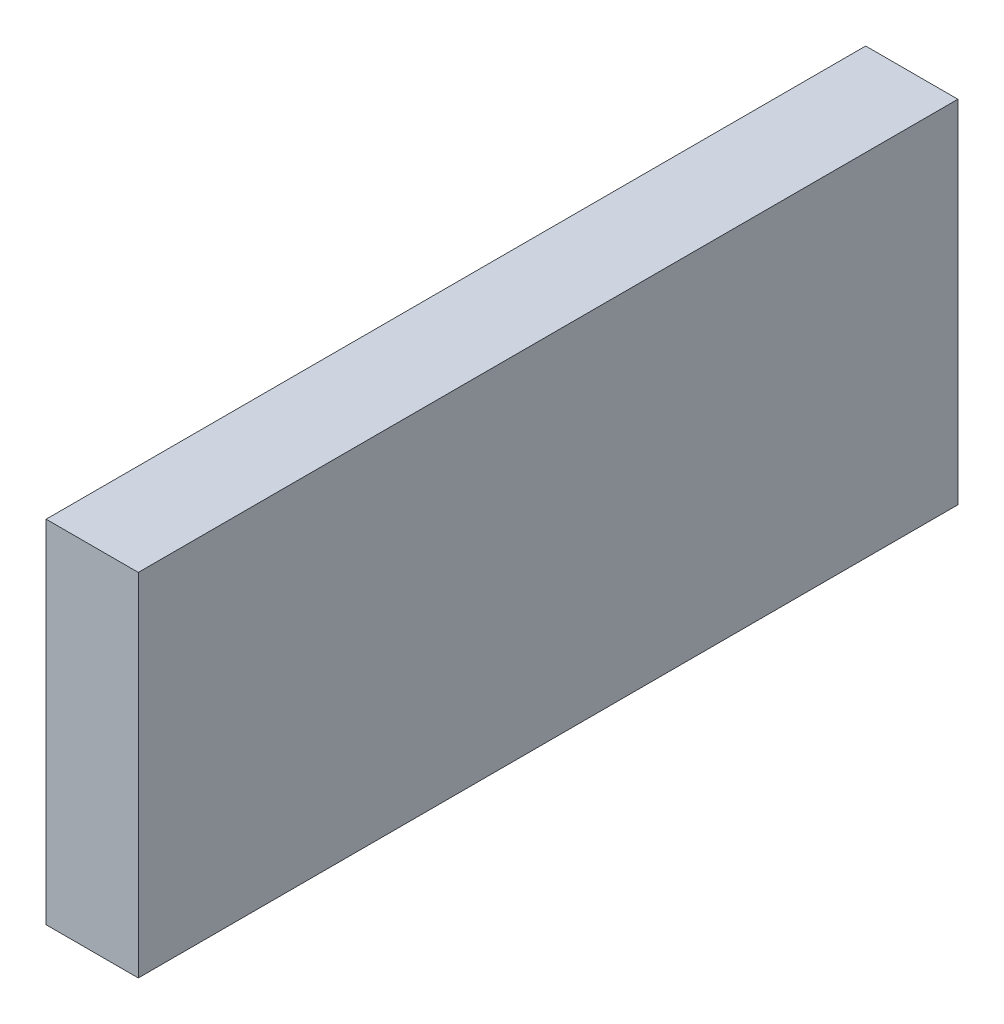
ISO-10303-21;
HEADER;
FILE_DESCRIPTION(('STEP AP214'),'2;1');
FILE_NAME('part.step','',(''),(''),'','','');
FILE_SCHEMA(('AUTOMOTIVE_DESIGN { 1 0 10303 214 1 1 1 1 }'));
ENDSEC;
DATA;
#1=APPLICATION_CONTEXT('core data for automotive mechanical design processes');
#2=APPLICATION_PROTOCOL_DEFINITION('international standard','automotive_design',2000,#1);
#3=PRODUCT_CONTEXT('',#1,'mechanical');
#4=PRODUCT('Part','Part','',(#3));
#5=PRODUCT_RELATED_PRODUCT_CATEGORY('part','',(#4));
#6=PRODUCT_DEFINITION_FORMATION('','',#4);
#7=PRODUCT_DEFINITION_CONTEXT('part definition',#1,'design');
#8=PRODUCT_DEFINITION('design','',#6,#7);
#9=PRODUCT_DEFINITION_SHAPE('','',#8);
#10=(LENGTH_UNIT() NAMED_UNIT(*) SI_UNIT(.MILLI.,.METRE.));
#11=(NAMED_UNIT(*) PLANE_ANGLE_UNIT() SI_UNIT($,.RADIAN.));
#12=(NAMED_UNIT(*) SI_UNIT($,.STERADIAN.) SOLID_ANGLE_UNIT());
#13=UNCERTAINTY_MEASURE_WITH_UNIT(LENGTH_MEASURE(1.E-05),#10,'distance_accuracy_value','');
#14=(GEOMETRIC_REPRESENTATION_CONTEXT(3) GLOBAL_UNCERTAINTY_ASSIGNED_CONTEXT((#13)) GLOBAL_UNIT_ASSIGNED_CONTEXT((#10,
#11,#12)) REPRESENTATION_CONTEXT('',''));
#15=CARTESIAN_POINT('',(0.,0.,0.));
#16=DIRECTION('',(0.,0.,1.));
#17=DIRECTION('',(1.,0.,0.));
#18=AXIS2_PLACEMENT_3D('',#15,#16,#17);
#19=CARTESIAN_POINT('',(10.,19.05,44.45));
#20=DIRECTION('',(0.,0.,-1.));
#21=DIRECTION('',(-1.,0.,0.));
#22=AXIS2_PLACEMENT_3D('',#19,#20,#21);
#23=PLANE('',#22);
#24=DIRECTION('',(0.,-1.,0.));
#25=VECTOR('',#24,1.);
#26=CARTESIAN_POINT('',(0.,19.05,44.45));
#27=LINE('',#26,#25);
#28=CARTESIAN_POINT('',(0.,19.05,44.45));
#29=VERTEX_POINT('',#28);
#30=CARTESIAN_POINT('',(0.,-19.05,44.45));
#31=VERTEX_POINT('',#30);
#32=EDGE_CURVE('E100',#29,#31,#27,.T.);
#33=ORIENTED_EDGE('',*,*,#32,.T.);
#34=DIRECTION('',(-1.,0.,0.));
#35=VECTOR('',#34,1.);
#36=CARTESIAN_POINT('',(10.,-19.05,44.45));
#37=LINE('',#36,#35);
#38=CARTESIAN_POINT('',(10.,-19.05,44.45));
#39=VERTEX_POINT('',#38);
#40=EDGE_CURVE('E11',#39,#31,#37,.T.);
#41=ORIENTED_EDGE('',*,*,#40,.F.);
#42=DIRECTION('',(0.,-1.,0.));
#43=VECTOR('',#42,1.);
#44=CARTESIAN_POINT('',(10.,19.05,44.45));
#45=LINE('',#44,#43);
#46=CARTESIAN_POINT('',(10.,19.05,44.45));
#47=VERTEX_POINT('',#46);
#48=EDGE_CURVE('E88',#47,#39,#45,.T.);
#49=ORIENTED_EDGE('',*,*,#48,.F.);
#50=DIRECTION('',(-1.,0.,0.));
#51=VECTOR('',#50,1.);
#52=CARTESIAN_POINT('',(10.,19.05,44.45));
#53=LINE('',#52,#51);
#54=EDGE_CURVE('E96',#47,#29,#53,.T.);
#55=ORIENTED_EDGE('',*,*,#54,.T.);
#56=EDGE_LOOP('',(#33,#41,#49,#55));
#57=FACE_BOUND('',#56,.T.);
#58=ADVANCED_FACE('F37',(#57),#23,.F.);
#59=CARTESIAN_POINT('',(10.,-19.05,44.45));
#60=DIRECTION('',(0.,1.,0.));
#61=DIRECTION('',(0.,0.,1.));
#62=AXIS2_PLACEMENT_3D('',#59,#60,#61);
#63=PLANE('',#62);
#64=DIRECTION('',(0.,0.,-1.));
#65=VECTOR('',#64,1.);
#66=CARTESIAN_POINT('',(0.,-19.05,44.45));
#67=LINE('',#66,#65);
#68=CARTESIAN_POINT('',(0.,-19.05,-44.45));
#69=VERTEX_POINT('',#68);
#70=EDGE_CURVE('E92',#31,#69,#67,.T.);
#71=ORIENTED_EDGE('',*,*,#70,.T.);
#72=DIRECTION('',(-1.,0.,0.));
#73=VECTOR('',#72,1.);
#74=CARTESIAN_POINT('',(10.,-19.05,-44.45));
#75=LINE('',#74,#73);
#76=CARTESIAN_POINT('',(10.,-19.05,-44.45));
#77=VERTEX_POINT('',#76);
#78=EDGE_CURVE('E45',#77,#69,#75,.T.);
#79=ORIENTED_EDGE('',*,*,#78,.F.);
#80=DIRECTION('',(0.,0.,-1.));
#81=VECTOR('',#80,1.);
#82=CARTESIAN_POINT('',(10.,-19.05,44.45));
#83=LINE('',#82,#81);
#84=EDGE_CURVE('E83',#39,#77,#83,.T.);
#85=ORIENTED_EDGE('',*,*,#84,.F.);
#86=ORIENTED_EDGE('',*,*,#40,.T.);
#87=EDGE_LOOP('',(#71,#79,#85,#86));
#88=FACE_BOUND('',#87,.T.);
#89=ADVANCED_FACE('F91',(#88),#63,.F.);
#90=CARTESIAN_POINT('',(10.,19.05,-44.45));
#91=DIRECTION('',(0.,0.,1.));
#92=DIRECTION('',(0.,-1.,0.));
#93=AXIS2_PLACEMENT_3D('',#90,#91,#92);
#94=PLANE('',#93);
#95=DIRECTION('',(0.,1.,0.));
#96=VECTOR('',#95,1.);
#97=CARTESIAN_POINT('',(0.,19.05,-44.45));
#98=LINE('',#97,#96);
#99=CARTESIAN_POINT('',(0.,19.05,-44.45));
#100=VERTEX_POINT('',#99);
#101=EDGE_CURVE('E70',#69,#100,#98,.T.);
#102=ORIENTED_EDGE('',*,*,#101,.T.);
#103=DIRECTION('',(-1.,0.,0.));
#104=VECTOR('',#103,1.);
#105=CARTESIAN_POINT('',(10.,19.05,-44.45));
#106=LINE('',#105,#104);
#107=CARTESIAN_POINT('',(10.,19.05,-44.45));
#108=VERTEX_POINT('',#107);
#109=EDGE_CURVE('E93',#108,#100,#106,.T.);
#110=ORIENTED_EDGE('',*,*,#109,.F.);
#111=DIRECTION('',(0.,1.,0.));
#112=VECTOR('',#111,1.);
#113=CARTESIAN_POINT('',(10.,19.05,-44.45));
#114=LINE('',#113,#112);
#115=EDGE_CURVE('E86',#77,#108,#114,.T.);
#116=ORIENTED_EDGE('',*,*,#115,.F.);
#117=ORIENTED_EDGE('',*,*,#78,.T.);
#118=EDGE_LOOP('',(#102,#110,#116,#117));
#119=FACE_BOUND('',#118,.T.);
#120=ADVANCED_FACE('F94',(#119),#94,.F.);
#121=CARTESIAN_POINT('',(10.,19.05,44.45));
#122=DIRECTION('',(0.,-1.,0.));
#123=DIRECTION('',(0.,0.,-1.));
#124=AXIS2_PLACEMENT_3D('',#121,#122,#123);
#125=PLANE('',#124);
#126=DIRECTION('',(0.,0.,1.));
#127=VECTOR('',#126,1.);
#128=CARTESIAN_POINT('',(0.,19.05,44.45));
#129=LINE('',#128,#127);
#130=EDGE_CURVE('E76',#100,#29,#129,.T.);
#131=ORIENTED_EDGE('',*,*,#130,.T.);
#132=ORIENTED_EDGE('',*,*,#54,.F.);
#133=DIRECTION('',(0.,0.,1.));
#134=VECTOR('',#133,1.);
#135=CARTESIAN_POINT('',(10.,19.05,44.45));
#136=LINE('',#135,#134);
#137=EDGE_CURVE('E53',#108,#47,#136,.T.);
#138=ORIENTED_EDGE('',*,*,#137,.F.);
#139=ORIENTED_EDGE('',*,*,#109,.T.);
#140=EDGE_LOOP('',(#131,#132,#138,#139));
#141=FACE_BOUND('',#140,.T.);
#142=ADVANCED_FACE('F107',(#141),#125,.F.);
#143=CARTESIAN_POINT('',(10.,0.,0.));
#144=DIRECTION('',(1.,0.,0.));
#145=DIRECTION('',(0.,0.,-1.));
#146=AXIS2_PLACEMENT_3D('',#143,#144,#145);
#147=PLANE('',#146);
#148=ORIENTED_EDGE('',*,*,#48,.T.);
#149=ORIENTED_EDGE('',*,*,#84,.T.);
#150=ORIENTED_EDGE('',*,*,#115,.T.);
#151=ORIENTED_EDGE('',*,*,#137,.T.);
#152=EDGE_LOOP('',(#148,#149,#150,#151));
#153=FACE_BOUND('',#152,.T.);
#154=ADVANCED_FACE('F84',(#153),#147,.T.);
#155=CARTESIAN_POINT('',(0.,0.,0.));
#156=DIRECTION('',(1.,0.,0.));
#157=DIRECTION('',(0.,0.,-1.));
#158=AXIS2_PLACEMENT_3D('',#155,#156,#157);
#159=PLANE('',#158);
#160=ORIENTED_EDGE('',*,*,#32,.F.);
#161=ORIENTED_EDGE('',*,*,#130,.F.);
#162=ORIENTED_EDGE('',*,*,#101,.F.);
#163=ORIENTED_EDGE('',*,*,#70,.F.);
#164=EDGE_LOOP('',(#160,#161,#162,#163));
#165=FACE_BOUND('',#164,.T.);
#166=ADVANCED_FACE('F110',(#165),#159,.F.);
#167=CLOSED_SHELL('',(#58,#89,#120,#142,#154,#166));
#168=MANIFOLD_SOLID_BREP('B2',#167);
#169=ADVANCED_BREP_SHAPE_REPRESENTATION('',(#18,#168),#14);
#170=SHAPE_DEFINITION_REPRESENTATION(#9,#169);
ENDSEC;
END-ISO-10303-21;
